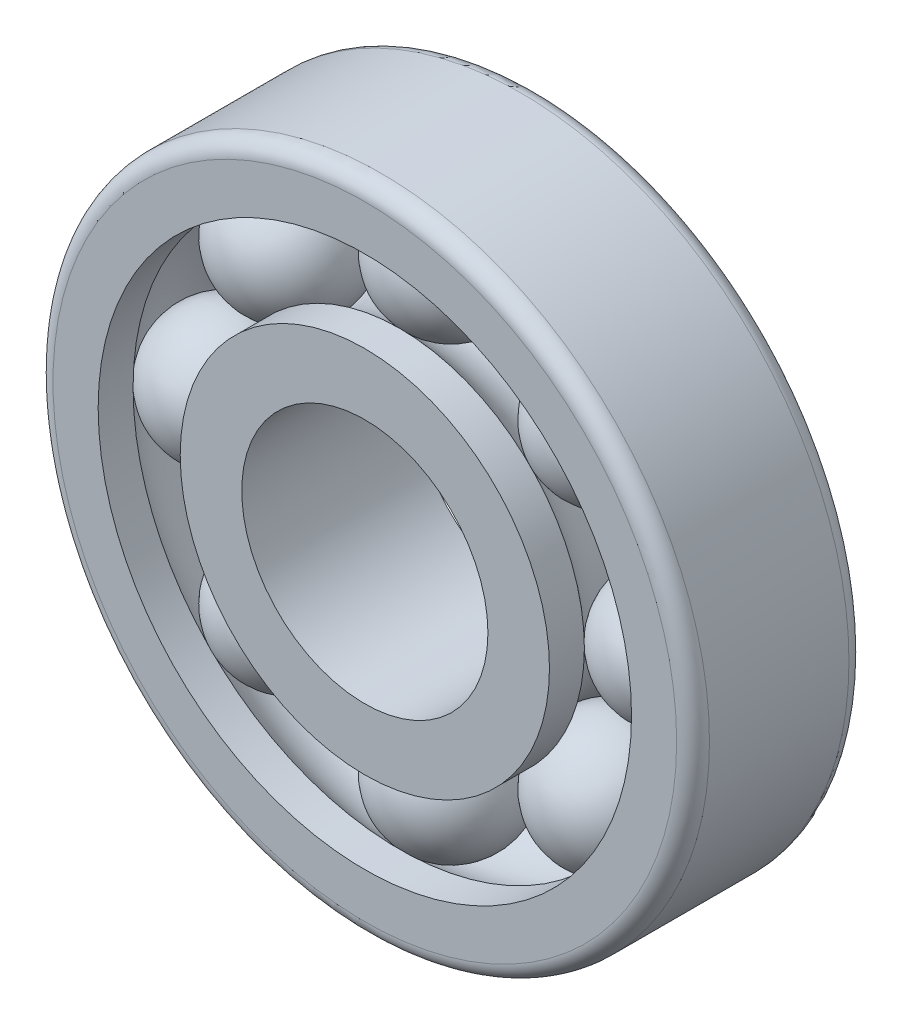
ISO-10303-21;
HEADER;
FILE_DESCRIPTION(('STEP AP214'),'2;1');
FILE_NAME('part.step','',(''),(''),'','','');
FILE_SCHEMA(('AUTOMOTIVE_DESIGN { 1 0 10303 214 1 1 1 1 }'));
ENDSEC;
DATA;
#1=APPLICATION_CONTEXT('core data for automotive mechanical design processes');
#2=APPLICATION_PROTOCOL_DEFINITION('international standard','automotive_design',2000,#1);
#3=PRODUCT_CONTEXT('',#1,'mechanical');
#4=PRODUCT('Part','Part','',(#3));
#5=PRODUCT_RELATED_PRODUCT_CATEGORY('part','',(#4));
#6=PRODUCT_DEFINITION_FORMATION('','',#4);
#7=PRODUCT_DEFINITION_CONTEXT('part definition',#1,'design');
#8=PRODUCT_DEFINITION('design','',#6,#7);
#9=PRODUCT_DEFINITION_SHAPE('','',#8);
#10=(LENGTH_UNIT() NAMED_UNIT(*) SI_UNIT(.MILLI.,.METRE.));
#11=(NAMED_UNIT(*) PLANE_ANGLE_UNIT() SI_UNIT($,.RADIAN.));
#12=(NAMED_UNIT(*) SI_UNIT($,.STERADIAN.) SOLID_ANGLE_UNIT());
#13=UNCERTAINTY_MEASURE_WITH_UNIT(LENGTH_MEASURE(1.E-05),#10,'distance_accuracy_value','');
#14=(GEOMETRIC_REPRESENTATION_CONTEXT(3) GLOBAL_UNCERTAINTY_ASSIGNED_CONTEXT((#13)) GLOBAL_UNIT_ASSIGNED_CONTEXT((#10,
#11,#12)) REPRESENTATION_CONTEXT('',''));
#15=CARTESIAN_POINT('',(0.,0.,0.));
#16=DIRECTION('',(0.,0.,1.));
#17=DIRECTION('',(1.,0.,0.));
#18=AXIS2_PLACEMENT_3D('',#15,#16,#17);
#19=CARTESIAN_POINT('',(19.4454364826303,-19.4454364826298,10.5));
#20=DIRECTION('',(0.,0.,-1.));
#21=DIRECTION('',(0.707106781186556,-0.707106781186539,0.));
#22=AXIS2_PLACEMENT_3D('',#19,#20,#21);
#23=SPHERICAL_SURFACE('',#22,8.);
#24=CARTESIAN_POINT('',(19.4454364826303,-19.4454364826298,2.50000000000001));
#25=VERTEX_POINT('',#24);
#26=VERTEX_LOOP('',#25);
#27=FACE_BOUND('',#26,.T.);
#28=ADVANCED_FACE('F52',(#27),#23,.T.);
#29=CLOSED_SHELL('',(#28));
#30=MANIFOLD_SOLID_BREP('B2',#29);
#31=CARTESIAN_POINT('',(2.88047210454559E-13,-27.5,10.5));
#32=DIRECTION('',(0.,0.,-1.));
#33=DIRECTION('',(0.,-1.,0.));
#34=AXIS2_PLACEMENT_3D('',#31,#32,#33);
#35=SPHERICAL_SURFACE('',#34,8.);
#36=CARTESIAN_POINT('',(2.88047210454559E-13,-27.5,2.50000000000001));
#37=VERTEX_POINT('',#36);
#38=VERTEX_LOOP('',#37);
#39=FACE_BOUND('',#38,.T.);
#40=ADVANCED_FACE('F73',(#39),#35,.T.);
#41=CLOSED_SHELL('',(#40));
#42=MANIFOLD_SOLID_BREP('B7',#41);
#43=CARTESIAN_POINT('',(-19.4454364826299,-19.4454364826302,10.5));
#44=DIRECTION('',(0.,0.,-1.));
#45=DIRECTION('',(-0.707106781186541,-0.707106781186554,0.));
#46=AXIS2_PLACEMENT_3D('',#43,#44,#45);
#47=SPHERICAL_SURFACE('',#46,8.);
#48=CARTESIAN_POINT('',(-19.4454364826299,-19.4454364826302,2.50000000000001));
#49=VERTEX_POINT('',#48);
#50=VERTEX_LOOP('',#49);
#51=FACE_BOUND('',#50,.T.);
#52=ADVANCED_FACE('F94',(#51),#47,.T.);
#53=CLOSED_SHELL('',(#52));
#54=MANIFOLD_SOLID_BREP('B48',#53);
#55=CARTESIAN_POINT('',(-27.5,0.,10.5));
#56=DIRECTION('',(0.,0.,-1.));
#57=DIRECTION('',(-1.,0.,0.));
#58=AXIS2_PLACEMENT_3D('',#55,#56,#57);
#59=SPHERICAL_SURFACE('',#58,8.);
#60=CARTESIAN_POINT('',(-27.5,0.,2.50000000000001));
#61=VERTEX_POINT('',#60);
#62=VERTEX_LOOP('',#61);
#63=FACE_BOUND('',#62,.T.);
#64=ADVANCED_FACE('F115',(#63),#59,.T.);
#65=CLOSED_SHELL('',(#64));
#66=MANIFOLD_SOLID_BREP('B69',#65);
#67=CARTESIAN_POINT('',(-19.4454364826302,19.44543648263,10.5));
#68=DIRECTION('',(0.,0.,-1.));
#69=DIRECTION('',(-0.707106781186551,0.707106781186544,0.));
#70=AXIS2_PLACEMENT_3D('',#67,#68,#69);
#71=SPHERICAL_SURFACE('',#70,8.);
#72=CARTESIAN_POINT('',(-19.4454364826302,19.44543648263,2.50000000000001));
#73=VERTEX_POINT('',#72);
#74=VERTEX_LOOP('',#73);
#75=FACE_BOUND('',#74,.T.);
#76=ADVANCED_FACE('F136',(#75),#71,.T.);
#77=CLOSED_SHELL('',(#76));
#78=MANIFOLD_SOLID_BREP('B90',#77);
#79=CARTESIAN_POINT('',(0.,27.5,10.5));
#80=DIRECTION('',(0.,0.,-1.));
#81=DIRECTION('',(0.,1.,0.));
#82=AXIS2_PLACEMENT_3D('',#79,#80,#81);
#83=SPHERICAL_SURFACE('',#82,8.);
#84=CARTESIAN_POINT('',(0.,27.5,2.50000000000001));
#85=VERTEX_POINT('',#84);
#86=VERTEX_LOOP('',#85);
#87=FACE_BOUND('',#86,.T.);
#88=ADVANCED_FACE('F157',(#87),#83,.T.);
#89=CLOSED_SHELL('',(#88));
#90=MANIFOLD_SOLID_BREP('B111',#89);
#91=CARTESIAN_POINT('',(19.44543648263,19.4454364826301,10.5));
#92=DIRECTION('',(0.,0.,-1.));
#93=DIRECTION('',(0.707106781186546,0.707106781186549,0.));
#94=AXIS2_PLACEMENT_3D('',#91,#92,#93);
#95=SPHERICAL_SURFACE('',#94,8.);
#96=CARTESIAN_POINT('',(19.44543648263,19.4454364826301,2.50000000000001));
#97=VERTEX_POINT('',#96);
#98=VERTEX_LOOP('',#97);
#99=FACE_BOUND('',#98,.T.);
#100=ADVANCED_FACE('F178',(#99),#95,.T.);
#101=CLOSED_SHELL('',(#100));
#102=MANIFOLD_SOLID_BREP('B132',#101);
#103=CARTESIAN_POINT('',(27.5,0.,10.5));
#104=DIRECTION('',(0.,0.,-1.));
#105=DIRECTION('',(1.,0.,0.));
#106=AXIS2_PLACEMENT_3D('',#103,#104,#105);
#107=SPHERICAL_SURFACE('',#106,8.);
#108=CARTESIAN_POINT('',(27.5,0.,2.50000000000001));
#109=VERTEX_POINT('',#108);
#110=VERTEX_LOOP('',#109);
#111=FACE_BOUND('',#110,.T.);
#112=ADVANCED_FACE('F201',(#111),#107,.T.);
#113=CLOSED_SHELL('',(#112));
#114=MANIFOLD_SOLID_BREP('B153',#113);
#115=CARTESIAN_POINT('',(0.,0.,21.));
#116=DIRECTION('',(0.,0.,-1.));
#117=DIRECTION('',(-1.,0.,0.));
#118=AXIS2_PLACEMENT_3D('',#115,#116,#117);
#119=CYLINDRICAL_SURFACE('',#118,22.5);
#120=CARTESIAN_POINT('',(0.,0.,16.7449979983984));
#121=DIRECTION('',(0.,0.,-1.));
#122=DIRECTION('',(-1.,0.,0.));
#123=AXIS2_PLACEMENT_3D('',#120,#121,#122);
#124=CIRCLE('',#123,22.5);
#125=CARTESIAN_POINT('',(-22.5,0.,16.7449979983984));
#126=VERTEX_POINT('',#125);
#127=EDGE_CURVE('E227',#126,#126,#124,.F.);
#128=ORIENTED_EDGE('',*,*,#127,.T.);
#129=EDGE_LOOP('',(#128));
#130=FACE_BOUND('',#129,.T.);
#131=CARTESIAN_POINT('',(0.,0.,21.));
#132=DIRECTION('',(0.,0.,1.));
#133=DIRECTION('',(1.,0.,0.));
#134=AXIS2_PLACEMENT_3D('',#131,#132,#133);
#135=CIRCLE('',#134,22.5);
#136=CARTESIAN_POINT('',(22.5,0.,21.));
#137=VERTEX_POINT('',#136);
#138=EDGE_CURVE('E200',#137,#137,#135,.T.);
#139=ORIENTED_EDGE('',*,*,#138,.F.);
#140=EDGE_LOOP('',(#139));
#141=FACE_BOUND('',#140,.T.);
#142=ADVANCED_FACE('F223',(#130,#141),#119,.T.);
#143=CARTESIAN_POINT('',(0.,0.,21.));
#144=DIRECTION('',(0.,0.,-1.));
#145=DIRECTION('',(-1.,0.,0.));
#146=AXIS2_PLACEMENT_3D('',#143,#144,#145);
#147=CYLINDRICAL_SURFACE('',#146,15.);
#148=CARTESIAN_POINT('',(0.,0.,21.));
#149=DIRECTION('',(0.,0.,1.));
#150=DIRECTION('',(1.,0.,0.));
#151=AXIS2_PLACEMENT_3D('',#148,#149,#150);
#152=CIRCLE('',#151,15.);
#153=CARTESIAN_POINT('',(15.,0.,21.));
#154=VERTEX_POINT('',#153);
#155=EDGE_CURVE('E231',#154,#154,#152,.T.);
#156=ORIENTED_EDGE('',*,*,#155,.T.);
#157=EDGE_LOOP('',(#156));
#158=FACE_BOUND('',#157,.T.);
#159=CARTESIAN_POINT('',(0.,0.,0.));
#160=DIRECTION('',(0.,0.,1.));
#161=DIRECTION('',(1.,0.,0.));
#162=AXIS2_PLACEMENT_3D('',#159,#160,#161);
#163=CIRCLE('',#162,15.);
#164=CARTESIAN_POINT('',(15.,0.,0.));
#165=VERTEX_POINT('',#164);
#166=EDGE_CURVE('E239',#165,#165,#163,.T.);
#167=ORIENTED_EDGE('',*,*,#166,.F.);
#168=EDGE_LOOP('',(#167));
#169=FACE_BOUND('',#168,.T.);
#170=ADVANCED_FACE('F225',(#158,#169),#147,.F.);
#171=CARTESIAN_POINT('',(0.,0.,4.25500200160161));
#172=DIRECTION('',(0.,0.,1.));
#173=DIRECTION('',(1.,0.,0.));
#174=AXIS2_PLACEMENT_3D('',#171,#172,#173);
#175=CIRCLE('',#174,22.5);
#176=CARTESIAN_POINT('',(22.5,0.,4.25500200160161));
#177=VERTEX_POINT('',#176);
#178=EDGE_CURVE('E243',#177,#177,#175,.F.);
#179=ORIENTED_EDGE('',*,*,#178,.T.);
#180=EDGE_LOOP('',(#179));
#181=FACE_BOUND('',#180,.T.);
#182=CARTESIAN_POINT('',(0.,0.,0.));
#183=DIRECTION('',(0.,0.,1.));
#184=DIRECTION('',(1.,0.,0.));
#185=AXIS2_PLACEMENT_3D('',#182,#183,#184);
#186=CIRCLE('',#185,22.5);
#187=CARTESIAN_POINT('',(22.5,0.,0.));
#188=VERTEX_POINT('',#187);
#189=EDGE_CURVE('E236',#188,#188,#186,.T.);
#190=ORIENTED_EDGE('',*,*,#189,.T.);
#191=EDGE_LOOP('',(#190));
#192=FACE_BOUND('',#191,.T.);
#193=ADVANCED_FACE('F265',(#181,#192),#119,.T.);
#194=CARTESIAN_POINT('',(0.,0.,21.));
#195=DIRECTION('',(0.,0.,1.));
#196=DIRECTION('',(1.,0.,0.));
#197=AXIS2_PLACEMENT_3D('',#194,#195,#196);
#198=PLANE('',#197);
#199=ORIENTED_EDGE('',*,*,#155,.F.);
#200=EDGE_LOOP('',(#199));
#201=FACE_BOUND('',#200,.T.);
#202=ORIENTED_EDGE('',*,*,#138,.T.);
#203=EDGE_LOOP('',(#202));
#204=FACE_BOUND('',#203,.T.);
#205=ADVANCED_FACE('F260',(#201,#204),#198,.T.);
#206=CARTESIAN_POINT('',(0.,0.,0.));
#207=DIRECTION('',(0.,0.,1.));
#208=DIRECTION('',(1.,0.,0.));
#209=AXIS2_PLACEMENT_3D('',#206,#207,#208);
#210=PLANE('',#209);
#211=ORIENTED_EDGE('',*,*,#166,.T.);
#212=EDGE_LOOP('',(#211));
#213=FACE_BOUND('',#212,.T.);
#214=ORIENTED_EDGE('',*,*,#189,.F.);
#215=EDGE_LOOP('',(#214));
#216=FACE_BOUND('',#215,.T.);
#217=ADVANCED_FACE('F254',(#213,#216),#210,.F.);
#218=CARTESIAN_POINT('',(0.,0.,10.5));
#219=DIRECTION('',(0.,0.,1.));
#220=DIRECTION('',(1.,0.,0.));
#221=AXIS2_PLACEMENT_3D('',#218,#219,#220);
#222=TOROIDAL_SURFACE('',#221,27.5,8.);
#223=ORIENTED_EDGE('',*,*,#178,.F.);
#224=EDGE_LOOP('',(#223));
#225=FACE_BOUND('',#224,.T.);
#226=ORIENTED_EDGE('',*,*,#127,.F.);
#227=EDGE_LOOP('',(#226));
#228=FACE_BOUND('',#227,.T.);
#229=ADVANCED_FACE('F252',(#225,#228),#222,.F.);
#230=CLOSED_SHELL('',(#142,#170,#193,#205,#217,#229));
#231=MANIFOLD_SOLID_BREP('B174',#230);
#232=CARTESIAN_POINT('',(0.,0.,21.));
#233=DIRECTION('',(0.,0.,-1.));
#234=DIRECTION('',(-1.,0.,0.));
#235=AXIS2_PLACEMENT_3D('',#232,#233,#234);
#236=CYLINDRICAL_SURFACE('',#235,32.5);
#237=CARTESIAN_POINT('',(0.,0.,16.7449979983984));
#238=DIRECTION('',(0.,0.,-1.));
#239=DIRECTION('',(-1.,0.,0.));
#240=AXIS2_PLACEMENT_3D('',#237,#238,#239);
#241=CIRCLE('',#240,32.5);
#242=CARTESIAN_POINT('',(-32.5,0.,16.7449979983984));
#243=VERTEX_POINT('',#242);
#244=EDGE_CURVE('E347',#243,#243,#241,.F.);
#245=ORIENTED_EDGE('',*,*,#244,.F.);
#246=EDGE_LOOP('',(#245));
#247=FACE_BOUND('',#246,.T.);
#248=CARTESIAN_POINT('',(0.,0.,21.));
#249=DIRECTION('',(0.,0.,1.));
#250=DIRECTION('',(1.,0.,0.));
#251=AXIS2_PLACEMENT_3D('',#248,#249,#250);
#252=CIRCLE('',#251,32.5);
#253=CARTESIAN_POINT('',(32.5,0.,21.));
#254=VERTEX_POINT('',#253);
#255=EDGE_CURVE('E346',#254,#254,#252,.T.);
#256=ORIENTED_EDGE('',*,*,#255,.T.);
#257=EDGE_LOOP('',(#256));
#258=FACE_BOUND('',#257,.T.);
#259=ADVANCED_FACE('F326',(#247,#258),#236,.F.);
#260=CARTESIAN_POINT('',(0.,0.,4.25500200160161));
#261=DIRECTION('',(0.,0.,1.));
#262=DIRECTION('',(1.,0.,0.));
#263=AXIS2_PLACEMENT_3D('',#260,#261,#262);
#264=CIRCLE('',#263,32.5);
#265=CARTESIAN_POINT('',(32.5,0.,4.25500200160161));
#266=VERTEX_POINT('',#265);
#267=EDGE_CURVE('E351',#266,#266,#264,.F.);
#268=ORIENTED_EDGE('',*,*,#267,.F.);
#269=EDGE_LOOP('',(#268));
#270=FACE_BOUND('',#269,.T.);
#271=CARTESIAN_POINT('',(0.,0.,0.));
#272=DIRECTION('',(0.,0.,1.));
#273=DIRECTION('',(1.,0.,0.));
#274=AXIS2_PLACEMENT_3D('',#271,#272,#273);
#275=CIRCLE('',#274,32.5);
#276=CARTESIAN_POINT('',(32.5,0.,0.));
#277=VERTEX_POINT('',#276);
#278=EDGE_CURVE('E350',#277,#277,#275,.T.);
#279=ORIENTED_EDGE('',*,*,#278,.F.);
#280=EDGE_LOOP('',(#279));
#281=FACE_BOUND('',#280,.T.);
#282=ADVANCED_FACE('F372',(#270,#281),#236,.F.);
#283=CARTESIAN_POINT('',(0.,0.,21.));
#284=DIRECTION('',(0.,0.,-1.));
#285=DIRECTION('',(-1.,0.,0.));
#286=AXIS2_PLACEMENT_3D('',#283,#284,#285);
#287=CYLINDRICAL_SURFACE('',#286,40.);
#288=CARTESIAN_POINT('',(0.,0.,19.));
#289=DIRECTION('',(0.,0.,1.));
#290=DIRECTION('',(1.,0.,0.));
#291=AXIS2_PLACEMENT_3D('',#288,#289,#290);
#292=CIRCLE('',#291,40.);
#293=CARTESIAN_POINT('',(40.,0.,19.));
#294=VERTEX_POINT('',#293);
#295=EDGE_CURVE('E333',#294,#294,#292,.F.);
#296=ORIENTED_EDGE('',*,*,#295,.T.);
#297=EDGE_LOOP('',(#296));
#298=FACE_BOUND('',#297,.T.);
#299=CARTESIAN_POINT('',(0.,0.,2.));
#300=DIRECTION('',(0.,0.,1.));
#301=DIRECTION('',(1.,0.,0.));
#302=AXIS2_PLACEMENT_3D('',#299,#300,#301);
#303=CIRCLE('',#302,40.);
#304=CARTESIAN_POINT('',(40.,0.,2.));
#305=VERTEX_POINT('',#304);
#306=EDGE_CURVE('E337',#305,#305,#303,.T.);
#307=ORIENTED_EDGE('',*,*,#306,.T.);
#308=EDGE_LOOP('',(#307));
#309=FACE_BOUND('',#308,.T.);
#310=ADVANCED_FACE('F363',(#298,#309),#287,.T.);
#311=CARTESIAN_POINT('',(0.,0.,21.));
#312=DIRECTION('',(0.,0.,1.));
#313=DIRECTION('',(1.,0.,0.));
#314=AXIS2_PLACEMENT_3D('',#311,#312,#313);
#315=PLANE('',#314);
#316=CARTESIAN_POINT('',(0.,0.,21.));
#317=DIRECTION('',(0.,0.,1.));
#318=DIRECTION('',(1.,0.,0.));
#319=AXIS2_PLACEMENT_3D('',#316,#317,#318);
#320=CIRCLE('',#319,38.);
#321=CARTESIAN_POINT('',(38.,0.,21.));
#322=VERTEX_POINT('',#321);
#323=EDGE_CURVE('E341',#322,#322,#320,.T.);
#324=ORIENTED_EDGE('',*,*,#323,.T.);
#325=EDGE_LOOP('',(#324));
#326=FACE_BOUND('',#325,.T.);
#327=ORIENTED_EDGE('',*,*,#255,.F.);
#328=EDGE_LOOP('',(#327));
#329=FACE_BOUND('',#328,.T.);
#330=ADVANCED_FACE('F360',(#326,#329),#315,.T.);
#331=CARTESIAN_POINT('',(0.,0.,0.));
#332=DIRECTION('',(0.,0.,1.));
#333=DIRECTION('',(1.,0.,0.));
#334=AXIS2_PLACEMENT_3D('',#331,#332,#333);
#335=PLANE('',#334);
#336=CARTESIAN_POINT('',(0.,0.,0.));
#337=DIRECTION('',(0.,0.,1.));
#338=DIRECTION('',(1.,0.,0.));
#339=AXIS2_PLACEMENT_3D('',#336,#337,#338);
#340=CIRCLE('',#339,38.);
#341=CARTESIAN_POINT('',(38.,0.,0.));
#342=VERTEX_POINT('',#341);
#343=EDGE_CURVE('E222',#342,#342,#340,.F.);
#344=ORIENTED_EDGE('',*,*,#343,.T.);
#345=EDGE_LOOP('',(#344));
#346=FACE_BOUND('',#345,.T.);
#347=ORIENTED_EDGE('',*,*,#278,.T.);
#348=EDGE_LOOP('',(#347));
#349=FACE_BOUND('',#348,.T.);
#350=ADVANCED_FACE('F362',(#346,#349),#335,.F.);
#351=CARTESIAN_POINT('',(0.,0.,10.5));
#352=DIRECTION('',(0.,0.,1.));
#353=DIRECTION('',(1.,0.,0.));
#354=AXIS2_PLACEMENT_3D('',#351,#352,#353);
#355=TOROIDAL_SURFACE('',#354,27.5,8.);
#356=ORIENTED_EDGE('',*,*,#244,.T.);
#357=EDGE_LOOP('',(#356));
#358=FACE_BOUND('',#357,.T.);
#359=ORIENTED_EDGE('',*,*,#267,.T.);
#360=EDGE_LOOP('',(#359));
#361=FACE_BOUND('',#360,.T.);
#362=ADVANCED_FACE('F370',(#358,#361),#355,.F.);
#363=CARTESIAN_POINT('',(0.,0.,19.));
#364=DIRECTION('',(0.,0.,1.));
#365=DIRECTION('',(1.,0.,0.));
#366=AXIS2_PLACEMENT_3D('',#363,#364,#365);
#367=TOROIDAL_SURFACE('',#366,38.,2.);
#368=ORIENTED_EDGE('',*,*,#295,.F.);
#369=EDGE_LOOP('',(#368));
#370=FACE_BOUND('',#369,.T.);
#371=ORIENTED_EDGE('',*,*,#323,.F.);
#372=EDGE_LOOP('',(#371));
#373=FACE_BOUND('',#372,.T.);
#374=ADVANCED_FACE('F383',(#370,#373),#367,.T.);
#375=CARTESIAN_POINT('',(0.,0.,2.));
#376=DIRECTION('',(0.,0.,1.));
#377=DIRECTION('',(1.,0.,0.));
#378=AXIS2_PLACEMENT_3D('',#375,#376,#377);
#379=TOROIDAL_SURFACE('',#378,38.,2.);
#380=ORIENTED_EDGE('',*,*,#343,.F.);
#381=EDGE_LOOP('',(#380));
#382=FACE_BOUND('',#381,.T.);
#383=ORIENTED_EDGE('',*,*,#306,.F.);
#384=EDGE_LOOP('',(#383));
#385=FACE_BOUND('',#384,.T.);
#386=ADVANCED_FACE('F328',(#382,#385),#379,.T.);
#387=CLOSED_SHELL('',(#259,#282,#310,#330,#350,#362,#374,#386));
#388=MANIFOLD_SOLID_BREP('B195',#387);
#389=ADVANCED_BREP_SHAPE_REPRESENTATION('',(#18,#30,#42,#54,#66,#78,#90,#102,#114,#231,#388),#14);
#390=SHAPE_DEFINITION_REPRESENTATION(#9,#389);
ENDSEC;
END-ISO-10303-21;
